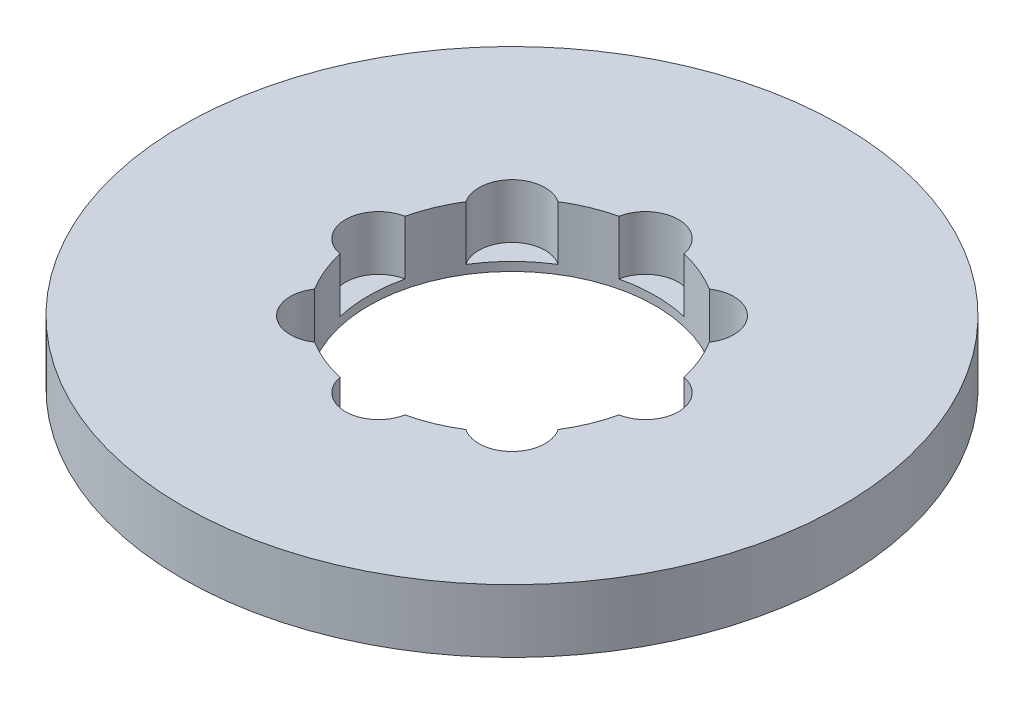
ISO-10303-21;
HEADER;
FILE_DESCRIPTION(('STEP AP214'),'2;1');
FILE_NAME('part.step','',(''),(''),'','','');
FILE_SCHEMA(('AUTOMOTIVE_DESIGN { 1 0 10303 214 1 1 1 1 }'));
ENDSEC;
DATA;
#1=APPLICATION_CONTEXT('core data for automotive mechanical design processes');
#2=APPLICATION_PROTOCOL_DEFINITION('international standard','automotive_design',2000,#1);
#3=PRODUCT_CONTEXT('',#1,'mechanical');
#4=PRODUCT('Part','Part','',(#3));
#5=PRODUCT_RELATED_PRODUCT_CATEGORY('part','',(#4));
#6=PRODUCT_DEFINITION_FORMATION('','',#4);
#7=PRODUCT_DEFINITION_CONTEXT('part definition',#1,'design');
#8=PRODUCT_DEFINITION('design','',#6,#7);
#9=PRODUCT_DEFINITION_SHAPE('','',#8);
#10=(LENGTH_UNIT() NAMED_UNIT(*) SI_UNIT(.MILLI.,.METRE.));
#11=(NAMED_UNIT(*) PLANE_ANGLE_UNIT() SI_UNIT($,.RADIAN.));
#12=(NAMED_UNIT(*) SI_UNIT($,.STERADIAN.) SOLID_ANGLE_UNIT());
#13=UNCERTAINTY_MEASURE_WITH_UNIT(LENGTH_MEASURE(1.E-05),#10,'distance_accuracy_value','');
#14=(GEOMETRIC_REPRESENTATION_CONTEXT(3) GLOBAL_UNCERTAINTY_ASSIGNED_CONTEXT((#13)) GLOBAL_UNIT_ASSIGNED_CONTEXT((#10,
#11,#12)) REPRESENTATION_CONTEXT('',''));
#15=CARTESIAN_POINT('',(0.,0.,0.));
#16=DIRECTION('',(0.,0.,1.));
#17=DIRECTION('',(1.,0.,0.));
#18=AXIS2_PLACEMENT_3D('',#15,#16,#17);
#19=CARTESIAN_POINT('',(0.,11.,0.));
#20=DIRECTION('',(0.,-1.,0.));
#21=DIRECTION('',(0.,0.,-1.));
#22=AXIS2_PLACEMENT_3D('',#19,#20,#21);
#23=CYLINDRICAL_SURFACE('',#22,57.5);
#24=CARTESIAN_POINT('',(0.,11.,0.));
#25=DIRECTION('',(0.,1.,0.));
#26=DIRECTION('',(0.,0.,1.));
#27=AXIS2_PLACEMENT_3D('',#24,#25,#26);
#28=CIRCLE('',#27,57.5);
#29=CARTESIAN_POINT('',(0.,11.,57.5));
#30=VERTEX_POINT('',#29);
#31=EDGE_CURVE('E183',#30,#30,#28,.T.);
#32=ORIENTED_EDGE('',*,*,#31,.F.);
#33=EDGE_LOOP('',(#32));
#34=FACE_BOUND('',#33,.T.);
#35=CARTESIAN_POINT('',(0.,0.,0.));
#36=DIRECTION('',(0.,1.,0.));
#37=DIRECTION('',(0.,0.,1.));
#38=AXIS2_PLACEMENT_3D('',#35,#36,#37);
#39=CIRCLE('',#38,57.5);
#40=CARTESIAN_POINT('',(0.,0.,57.5));
#41=VERTEX_POINT('',#40);
#42=EDGE_CURVE('E182',#41,#41,#39,.T.);
#43=ORIENTED_EDGE('',*,*,#42,.T.);
#44=EDGE_LOOP('',(#43));
#45=FACE_BOUND('',#44,.T.);
#46=ADVANCED_FACE('F39',(#34,#45),#23,.T.);
#47=CARTESIAN_POINT('',(0.,11.,0.));
#48=DIRECTION('',(0.,1.,0.));
#49=DIRECTION('',(0.,0.,1.));
#50=AXIS2_PLACEMENT_3D('',#47,#48,#49);
#51=PLANE('',#50);
#52=CARTESIAN_POINT('',(0.,11.,23.2714570066011));
#53=DIRECTION('',(0.,1.,0.));
#54=DIRECTION('',(1.,0.,0.));
#55=AXIS2_PLACEMENT_3D('',#52,#53,#54);
#56=CIRCLE('',#55,5.77688064739009);
#57=CARTESIAN_POINT('',(-5.67584231258927,11.,24.3471726087984));
#58=VERTEX_POINT('',#57);
#59=CARTESIAN_POINT('',(5.67584231258944,11.,24.3471726087983));
#60=VERTEX_POINT('',#59);
#61=EDGE_CURVE('E256',#58,#60,#56,.T.);
#62=ORIENTED_EDGE('',*,*,#61,.F.);
#63=CARTESIAN_POINT('',(0.,11.,0.));
#64=DIRECTION('',(0.,1.,0.));
#65=DIRECTION('',(0.,0.,1.));
#66=AXIS2_PLACEMENT_3D('',#63,#64,#65);
#67=CIRCLE('',#66,25.);
#68=CARTESIAN_POINT('',(-13.2026242662232,11.,21.2294774425782));
#69=VERTEX_POINT('',#68);
#70=EDGE_CURVE('E175',#69,#58,#67,.T.);
#71=ORIENTED_EDGE('',*,*,#70,.F.);
#72=CARTESIAN_POINT('',(-16.4554050574588,11.,16.4554050574589));
#73=DIRECTION('',(0.,1.,0.));
#74=DIRECTION('',(0.707106781186549,0.,0.707106781186546));
#75=AXIS2_PLACEMENT_3D('',#72,#73,#74);
#76=CIRCLE('',#75,5.77688064739009);
#77=CARTESIAN_POINT('',(-21.2294774425781,11.,13.2026242662232));
#78=VERTEX_POINT('',#77);
#79=EDGE_CURVE('E152',#78,#69,#76,.T.);
#80=ORIENTED_EDGE('',*,*,#79,.F.);
#81=CARTESIAN_POINT('',(-24.3471726087983,11.,5.67584231258935));
#82=VERTEX_POINT('',#81);
#83=EDGE_CURVE('E168',#82,#78,#67,.T.);
#84=ORIENTED_EDGE('',*,*,#83,.F.);
#85=CARTESIAN_POINT('',(-23.2714570066011,11.,0.));
#86=DIRECTION('',(0.,1.,0.));
#87=DIRECTION('',(0.,0.,1.));
#88=AXIS2_PLACEMENT_3D('',#85,#86,#87);
#89=CIRCLE('',#88,5.77688064739009);
#90=CARTESIAN_POINT('',(-24.3471726087983,11.,-5.67584231258935));
#91=VERTEX_POINT('',#90);
#92=EDGE_CURVE('E205',#91,#82,#89,.T.);
#93=ORIENTED_EDGE('',*,*,#92,.F.);
#94=CARTESIAN_POINT('',(-21.2294774425783,11.,-13.2026242662229));
#95=VERTEX_POINT('',#94);
#96=EDGE_CURVE('E181',#95,#91,#67,.T.);
#97=ORIENTED_EDGE('',*,*,#96,.F.);
#98=CARTESIAN_POINT('',(-16.4554050574591,11.,-16.4554050574587));
#99=DIRECTION('',(0.,1.,0.));
#100=DIRECTION('',(-0.707106781186539,0.,0.707106781186556));
#101=AXIS2_PLACEMENT_3D('',#98,#99,#100);
#102=CIRCLE('',#101,5.77688064739009);
#103=CARTESIAN_POINT('',(-13.2026242662235,11.,-21.229477442578));
#104=VERTEX_POINT('',#103);
#105=EDGE_CURVE('E453',#104,#95,#102,.T.);
#106=ORIENTED_EDGE('',*,*,#105,.F.);
#107=CARTESIAN_POINT('',(-5.67584231258961,11.,-24.3471726087983));
#108=VERTEX_POINT('',#107);
#109=EDGE_CURVE('E189',#108,#104,#67,.T.);
#110=ORIENTED_EDGE('',*,*,#109,.F.);
#111=CARTESIAN_POINT('',(-2.43755573598714E-13,11.,-23.2714570066011));
#112=DIRECTION('',(0.,1.,0.));
#113=DIRECTION('',(-1.,0.,0.));
#114=AXIS2_PLACEMENT_3D('',#111,#112,#113);
#115=CIRCLE('',#114,5.77688064739009);
#116=CARTESIAN_POINT('',(5.6758423125891,11.,-24.3471726087984));
#117=VERTEX_POINT('',#116);
#118=EDGE_CURVE('E462',#117,#108,#115,.T.);
#119=ORIENTED_EDGE('',*,*,#118,.F.);
#120=CARTESIAN_POINT('',(13.202624266223,11.,-21.2294774425783));
#121=VERTEX_POINT('',#120);
#122=EDGE_CURVE('E197',#121,#117,#67,.T.);
#123=ORIENTED_EDGE('',*,*,#122,.F.);
#124=CARTESIAN_POINT('',(16.4554050574587,11.,-16.455405057459));
#125=DIRECTION('',(0.,1.,0.));
#126=DIRECTION('',(-0.707106781186554,0.,-0.707106781186541));
#127=AXIS2_PLACEMENT_3D('',#124,#125,#126);
#128=CIRCLE('',#127,5.77688064739009);
#129=CARTESIAN_POINT('',(21.229477442578,11.,-13.2026242662234));
#130=VERTEX_POINT('',#129);
#131=EDGE_CURVE('E470',#130,#121,#128,.T.);
#132=ORIENTED_EDGE('',*,*,#131,.F.);
#133=CARTESIAN_POINT('',(24.3471726087983,11.,-5.67584231258935));
#134=VERTEX_POINT('',#133);
#135=EDGE_CURVE('E489',#134,#130,#67,.T.);
#136=ORIENTED_EDGE('',*,*,#135,.F.);
#137=CARTESIAN_POINT('',(23.2714570066011,11.,0.));
#138=DIRECTION('',(0.,1.,0.));
#139=DIRECTION('',(0.,0.,-1.));
#140=AXIS2_PLACEMENT_3D('',#137,#138,#139);
#141=CIRCLE('',#140,5.77688064739009);
#142=CARTESIAN_POINT('',(24.3471726087983,11.,5.67584231258935));
#143=VERTEX_POINT('',#142);
#144=EDGE_CURVE('E476',#143,#134,#141,.T.);
#145=ORIENTED_EDGE('',*,*,#144,.F.);
#146=CARTESIAN_POINT('',(21.2294774425782,11.,13.2026242662231));
#147=VERTEX_POINT('',#146);
#148=EDGE_CURVE('E491',#147,#143,#67,.T.);
#149=ORIENTED_EDGE('',*,*,#148,.F.);
#150=CARTESIAN_POINT('',(16.4554050574589,11.,16.4554050574588));
#151=DIRECTION('',(0.,1.,0.));
#152=DIRECTION('',(0.707106781186544,0.,-0.707106781186551));
#153=AXIS2_PLACEMENT_3D('',#150,#151,#152);
#154=CIRCLE('',#153,5.77688064739009);
#155=CARTESIAN_POINT('',(13.2026242662233,11.,21.2294774425781));
#156=VERTEX_POINT('',#155);
#157=EDGE_CURVE('E475',#156,#147,#154,.T.);
#158=ORIENTED_EDGE('',*,*,#157,.F.);
#159=EDGE_CURVE('E190',#60,#156,#67,.T.);
#160=ORIENTED_EDGE('',*,*,#159,.F.);
#161=EDGE_LOOP('',(#62,#71,#80,#84,#93,#97,#106,#110,#119,#123,#132,#136,#145,#149,#158,#160));
#162=FACE_BOUND('',#161,.T.);
#163=ORIENTED_EDGE('',*,*,#31,.T.);
#164=EDGE_LOOP('',(#163));
#165=FACE_BOUND('',#164,.T.);
#166=ADVANCED_FACE('F170',(#162,#165),#51,.T.);
#167=CARTESIAN_POINT('',(0.,0.,0.));
#168=DIRECTION('',(0.,1.,0.));
#169=DIRECTION('',(0.,0.,1.));
#170=AXIS2_PLACEMENT_3D('',#167,#168,#169);
#171=PLANE('',#170);
#172=CARTESIAN_POINT('',(0.,0.,0.));
#173=DIRECTION('',(0.,1.,0.));
#174=DIRECTION('',(0.,0.,1.));
#175=AXIS2_PLACEMENT_3D('',#172,#173,#174);
#176=CIRCLE('',#175,25.);
#177=CARTESIAN_POINT('',(0.,0.,25.));
#178=VERTEX_POINT('',#177);
#179=EDGE_CURVE('E191',#178,#178,#176,.T.);
#180=ORIENTED_EDGE('',*,*,#179,.T.);
#181=EDGE_LOOP('',(#180));
#182=FACE_BOUND('',#181,.T.);
#183=ORIENTED_EDGE('',*,*,#42,.F.);
#184=EDGE_LOOP('',(#183));
#185=FACE_BOUND('',#184,.T.);
#186=ADVANCED_FACE('F277',(#182,#185),#171,.F.);
#187=CARTESIAN_POINT('',(0.,11.,0.));
#188=DIRECTION('',(0.,-1.,0.));
#189=DIRECTION('',(0.,0.,-1.));
#190=AXIS2_PLACEMENT_3D('',#187,#188,#189);
#191=CYLINDRICAL_SURFACE('',#190,25.);
#192=DIRECTION('',(0.,1.,0.));
#193=VECTOR('',#192,1.);
#194=CARTESIAN_POINT('',(-5.67584231258927,6.25967291410345,24.3471726087984));
#195=LINE('',#194,#193);
#196=CARTESIAN_POINT('',(-5.67584231258927,1.51934582820691,24.3471726087984));
#197=VERTEX_POINT('',#196);
#198=EDGE_CURVE('E11',#197,#58,#195,.T.);
#199=ORIENTED_EDGE('',*,*,#198,.F.);
#200=CARTESIAN_POINT('',(0.,1.51934582820691,0.));
#201=DIRECTION('',(0.,1.,0.));
#202=DIRECTION('',(0.,0.,1.));
#203=AXIS2_PLACEMENT_3D('',#200,#201,#202);
#204=CIRCLE('',#203,25.);
#205=CARTESIAN_POINT('',(5.67584231258944,1.51934582820691,24.3471726087983));
#206=VERTEX_POINT('',#205);
#207=EDGE_CURVE('E251',#197,#206,#204,.T.);
#208=ORIENTED_EDGE('',*,*,#207,.T.);
#209=DIRECTION('',(0.,1.,0.));
#210=VECTOR('',#209,1.);
#211=CARTESIAN_POINT('',(5.67584231258944,6.25967291410345,24.3471726087983));
#212=LINE('',#211,#210);
#213=EDGE_CURVE('E46',#60,#206,#212,.F.);
#214=ORIENTED_EDGE('',*,*,#213,.F.);
#215=ORIENTED_EDGE('',*,*,#159,.T.);
#216=DIRECTION('',(0.,1.,0.));
#217=VECTOR('',#216,1.);
#218=CARTESIAN_POINT('',(13.2026242662233,6.25967291410345,21.2294774425781));
#219=LINE('',#218,#217);
#220=CARTESIAN_POINT('',(13.2026242662233,1.51934582820691,21.2294774425781));
#221=VERTEX_POINT('',#220);
#222=EDGE_CURVE('E253',#221,#156,#219,.T.);
#223=ORIENTED_EDGE('',*,*,#222,.F.);
#224=CARTESIAN_POINT('',(0.,1.51934582820691,0.));
#225=DIRECTION('',(0.,1.,0.));
#226=DIRECTION('',(0.,0.,1.));
#227=AXIS2_PLACEMENT_3D('',#224,#225,#226);
#228=CIRCLE('',#227,25.);
#229=CARTESIAN_POINT('',(21.2294774425782,1.51934582820691,13.2026242662231));
#230=VERTEX_POINT('',#229);
#231=EDGE_CURVE('E246',#221,#230,#228,.T.);
#232=ORIENTED_EDGE('',*,*,#231,.T.);
#233=DIRECTION('',(0.,1.,0.));
#234=VECTOR('',#233,1.);
#235=CARTESIAN_POINT('',(21.2294774425782,6.25967291410345,13.2026242662231));
#236=LINE('',#235,#234);
#237=EDGE_CURVE('E248',#147,#230,#236,.F.);
#238=ORIENTED_EDGE('',*,*,#237,.F.);
#239=ORIENTED_EDGE('',*,*,#148,.T.);
#240=DIRECTION('',(0.,1.,0.));
#241=VECTOR('',#240,1.);
#242=CARTESIAN_POINT('',(24.3471726087983,6.25967291410345,5.67584231258935));
#243=LINE('',#242,#241);
#244=CARTESIAN_POINT('',(24.3471726087983,1.51934582820691,5.67584231258935));
#245=VERTEX_POINT('',#244);
#246=EDGE_CURVE('E243',#245,#143,#243,.T.);
#247=ORIENTED_EDGE('',*,*,#246,.F.);
#248=CARTESIAN_POINT('',(0.,1.51934582820691,0.));
#249=DIRECTION('',(0.,1.,0.));
#250=DIRECTION('',(0.,0.,1.));
#251=AXIS2_PLACEMENT_3D('',#248,#249,#250);
#252=CIRCLE('',#251,25.);
#253=CARTESIAN_POINT('',(24.3471726087983,1.51934582820691,-5.67584231258935));
#254=VERTEX_POINT('',#253);
#255=EDGE_CURVE('E236',#245,#254,#252,.T.);
#256=ORIENTED_EDGE('',*,*,#255,.T.);
#257=DIRECTION('',(0.,1.,0.));
#258=VECTOR('',#257,1.);
#259=CARTESIAN_POINT('',(24.3471726087983,6.25967291410345,-5.67584231258935));
#260=LINE('',#259,#258);
#261=EDGE_CURVE('E241',#134,#254,#260,.F.);
#262=ORIENTED_EDGE('',*,*,#261,.F.);
#263=ORIENTED_EDGE('',*,*,#135,.T.);
#264=DIRECTION('',(0.,1.,0.));
#265=VECTOR('',#264,1.);
#266=CARTESIAN_POINT('',(21.229477442578,6.25967291410345,-13.2026242662234));
#267=LINE('',#266,#265);
#268=CARTESIAN_POINT('',(21.229477442578,1.51934582820691,-13.2026242662234));
#269=VERTEX_POINT('',#268);
#270=EDGE_CURVE('E237',#269,#130,#267,.T.);
#271=ORIENTED_EDGE('',*,*,#270,.F.);
#272=CARTESIAN_POINT('',(0.,1.51934582820691,0.));
#273=DIRECTION('',(0.,1.,0.));
#274=DIRECTION('',(0.,0.,1.));
#275=AXIS2_PLACEMENT_3D('',#272,#273,#274);
#276=CIRCLE('',#275,25.);
#277=CARTESIAN_POINT('',(13.202624266223,1.51934582820691,-21.2294774425783));
#278=VERTEX_POINT('',#277);
#279=EDGE_CURVE('E229',#269,#278,#276,.T.);
#280=ORIENTED_EDGE('',*,*,#279,.T.);
#281=DIRECTION('',(0.,1.,0.));
#282=VECTOR('',#281,1.);
#283=CARTESIAN_POINT('',(13.202624266223,6.25967291410345,-21.2294774425783));
#284=LINE('',#283,#282);
#285=EDGE_CURVE('E232',#121,#278,#284,.F.);
#286=ORIENTED_EDGE('',*,*,#285,.F.);
#287=ORIENTED_EDGE('',*,*,#122,.T.);
#288=DIRECTION('',(0.,1.,0.));
#289=VECTOR('',#288,1.);
#290=CARTESIAN_POINT('',(5.6758423125891,6.25967291410345,-24.3471726087984));
#291=LINE('',#290,#289);
#292=CARTESIAN_POINT('',(5.6758423125891,1.51934582820691,-24.3471726087984));
#293=VERTEX_POINT('',#292);
#294=EDGE_CURVE('E227',#293,#117,#291,.T.);
#295=ORIENTED_EDGE('',*,*,#294,.F.);
#296=CARTESIAN_POINT('',(0.,1.51934582820691,0.));
#297=DIRECTION('',(0.,1.,0.));
#298=DIRECTION('',(0.,0.,1.));
#299=AXIS2_PLACEMENT_3D('',#296,#297,#298);
#300=CIRCLE('',#299,25.);
#301=CARTESIAN_POINT('',(-5.67584231258961,1.51934582820691,-24.3471726087983));
#302=VERTEX_POINT('',#301);
#303=EDGE_CURVE('E225',#293,#302,#300,.T.);
#304=ORIENTED_EDGE('',*,*,#303,.T.);
#305=DIRECTION('',(0.,1.,0.));
#306=VECTOR('',#305,1.);
#307=CARTESIAN_POINT('',(-5.67584231258961,6.25967291410345,-24.3471726087983));
#308=LINE('',#307,#306);
#309=EDGE_CURVE('E223',#108,#302,#308,.F.);
#310=ORIENTED_EDGE('',*,*,#309,.F.);
#311=ORIENTED_EDGE('',*,*,#109,.T.);
#312=DIRECTION('',(0.,1.,0.));
#313=VECTOR('',#312,1.);
#314=CARTESIAN_POINT('',(-13.2026242662235,6.25967291410345,-21.229477442578));
#315=LINE('',#314,#313);
#316=CARTESIAN_POINT('',(-13.2026242662235,1.51934582820691,-21.229477442578));
#317=VERTEX_POINT('',#316);
#318=EDGE_CURVE('E219',#317,#104,#315,.T.);
#319=ORIENTED_EDGE('',*,*,#318,.F.);
#320=CARTESIAN_POINT('',(0.,1.51934582820691,0.));
#321=DIRECTION('',(0.,1.,0.));
#322=DIRECTION('',(0.,0.,1.));
#323=AXIS2_PLACEMENT_3D('',#320,#321,#322);
#324=CIRCLE('',#323,25.);
#325=CARTESIAN_POINT('',(-21.2294774425783,1.51934582820691,-13.2026242662229));
#326=VERTEX_POINT('',#325);
#327=EDGE_CURVE('E159',#317,#326,#324,.T.);
#328=ORIENTED_EDGE('',*,*,#327,.T.);
#329=DIRECTION('',(0.,1.,0.));
#330=VECTOR('',#329,1.);
#331=CARTESIAN_POINT('',(-21.2294774425783,6.25967291410345,-13.2026242662229));
#332=LINE('',#331,#330);
#333=EDGE_CURVE('E220',#95,#326,#332,.F.);
#334=ORIENTED_EDGE('',*,*,#333,.F.);
#335=ORIENTED_EDGE('',*,*,#96,.T.);
#336=DIRECTION('',(0.,1.,0.));
#337=VECTOR('',#336,1.);
#338=CARTESIAN_POINT('',(-24.3471726087983,6.25967291410345,-5.67584231258935));
#339=LINE('',#338,#337);
#340=CARTESIAN_POINT('',(-24.3471726087983,1.51934582820691,-5.67584231258935));
#341=VERTEX_POINT('',#340);
#342=EDGE_CURVE('E209',#341,#91,#339,.T.);
#343=ORIENTED_EDGE('',*,*,#342,.F.);
#344=CARTESIAN_POINT('',(0.,1.51934582820691,0.));
#345=DIRECTION('',(0.,1.,0.));
#346=DIRECTION('',(0.,0.,1.));
#347=AXIS2_PLACEMENT_3D('',#344,#345,#346);
#348=CIRCLE('',#347,25.);
#349=CARTESIAN_POINT('',(-24.3471726087983,1.51934582820691,5.67584231258935));
#350=VERTEX_POINT('',#349);
#351=EDGE_CURVE('E206',#341,#350,#348,.T.);
#352=ORIENTED_EDGE('',*,*,#351,.T.);
#353=DIRECTION('',(0.,1.,0.));
#354=VECTOR('',#353,1.);
#355=CARTESIAN_POINT('',(-24.3471726087983,6.25967291410345,5.67584231258935));
#356=LINE('',#355,#354);
#357=EDGE_CURVE('E179',#82,#350,#356,.F.);
#358=ORIENTED_EDGE('',*,*,#357,.F.);
#359=ORIENTED_EDGE('',*,*,#83,.T.);
#360=DIRECTION('',(0.,1.,0.));
#361=VECTOR('',#360,1.);
#362=CARTESIAN_POINT('',(-21.2294774425781,6.25967291410345,13.2026242662232));
#363=LINE('',#362,#361);
#364=CARTESIAN_POINT('',(-21.2294774425781,1.51934582820691,13.2026242662232));
#365=VERTEX_POINT('',#364);
#366=EDGE_CURVE('E147',#365,#78,#363,.T.);
#367=ORIENTED_EDGE('',*,*,#366,.F.);
#368=CARTESIAN_POINT('',(0.,1.51934582820691,0.));
#369=DIRECTION('',(0.,1.,0.));
#370=DIRECTION('',(0.,0.,1.));
#371=AXIS2_PLACEMENT_3D('',#368,#369,#370);
#372=CIRCLE('',#371,25.);
#373=CARTESIAN_POINT('',(-13.2026242662232,1.51934582820691,21.2294774425782));
#374=VERTEX_POINT('',#373);
#375=EDGE_CURVE('E215',#365,#374,#372,.T.);
#376=ORIENTED_EDGE('',*,*,#375,.T.);
#377=DIRECTION('',(0.,1.,0.));
#378=VECTOR('',#377,1.);
#379=CARTESIAN_POINT('',(-13.2026242662232,6.25967291410345,21.2294774425782));
#380=LINE('',#379,#378);
#381=EDGE_CURVE('E161',#69,#374,#380,.F.);
#382=ORIENTED_EDGE('',*,*,#381,.F.);
#383=ORIENTED_EDGE('',*,*,#70,.T.);
#384=EDGE_LOOP('',(#199,#208,#214,#215,#223,#232,#238,#239,#247,#256,#262,#263,#271,#280,#286,
#287,#295,#304,#310,#311,#319,#328,#334,#335,#343,#352,#358,#359,#367,#376,#382,#383));
#385=FACE_BOUND('',#384,.T.);
#386=ORIENTED_EDGE('',*,*,#179,.F.);
#387=EDGE_LOOP('',(#386));
#388=FACE_BOUND('',#387,.T.);
#389=ADVANCED_FACE('F176',(#385,#388),#191,.F.);
#390=CARTESIAN_POINT('',(-23.2714570066011,1.51934582820691,0.));
#391=DIRECTION('',(0.,1.,0.));
#392=DIRECTION('',(0.,0.,1.));
#393=AXIS2_PLACEMENT_3D('',#390,#391,#392);
#394=CYLINDRICAL_SURFACE('',#393,5.77688064739009);
#395=ORIENTED_EDGE('',*,*,#342,.T.);
#396=ORIENTED_EDGE('',*,*,#92,.T.);
#397=ORIENTED_EDGE('',*,*,#357,.T.);
#398=CARTESIAN_POINT('',(-23.2714570066011,1.51934582820691,0.));
#399=DIRECTION('',(0.,1.,0.));
#400=DIRECTION('',(0.,0.,1.));
#401=AXIS2_PLACEMENT_3D('',#398,#399,#400);
#402=CIRCLE('',#401,5.77688064739009);
#403=EDGE_CURVE('E200',#341,#350,#402,.T.);
#404=ORIENTED_EDGE('',*,*,#403,.F.);
#405=EDGE_LOOP('',(#395,#396,#397,#404));
#406=FACE_BOUND('',#405,.T.);
#407=ADVANCED_FACE('F286',(#406),#394,.F.);
#408=CARTESIAN_POINT('',(-23.2714570066011,1.51934582820691,0.));
#409=DIRECTION('',(0.,1.,0.));
#410=DIRECTION('',(0.,0.,1.));
#411=AXIS2_PLACEMENT_3D('',#408,#409,#410);
#412=PLANE('',#411);
#413=ORIENTED_EDGE('',*,*,#403,.T.);
#414=ORIENTED_EDGE('',*,*,#351,.F.);
#415=EDGE_LOOP('',(#413,#414));
#416=FACE_BOUND('',#415,.T.);
#417=ADVANCED_FACE('F289',(#416),#412,.T.);
#418=CARTESIAN_POINT('',(-16.4554050574588,1.51934582820691,16.4554050574589));
#419=DIRECTION('',(0.,1.,0.));
#420=DIRECTION('',(0.,0.,1.));
#421=AXIS2_PLACEMENT_3D('',#418,#419,#420);
#422=CYLINDRICAL_SURFACE('',#421,5.77688064739009);
#423=ORIENTED_EDGE('',*,*,#366,.T.);
#424=ORIENTED_EDGE('',*,*,#79,.T.);
#425=ORIENTED_EDGE('',*,*,#381,.T.);
#426=CARTESIAN_POINT('',(-16.4554050574588,1.51934582820691,16.4554050574589));
#427=DIRECTION('',(0.,1.,0.));
#428=DIRECTION('',(0.707106781186549,0.,0.707106781186546));
#429=AXIS2_PLACEMENT_3D('',#426,#427,#428);
#430=CIRCLE('',#429,5.77688064739009);
#431=EDGE_CURVE('E156',#365,#374,#430,.T.);
#432=ORIENTED_EDGE('',*,*,#431,.F.);
#433=EDGE_LOOP('',(#423,#424,#425,#432));
#434=FACE_BOUND('',#433,.T.);
#435=ADVANCED_FACE('F155',(#434),#422,.F.);
#436=CARTESIAN_POINT('',(-16.4554050574588,1.51934582820691,16.4554050574589));
#437=DIRECTION('',(0.,1.,0.));
#438=DIRECTION('',(0.707106781186549,0.,0.707106781186546));
#439=AXIS2_PLACEMENT_3D('',#436,#437,#438);
#440=PLANE('',#439);
#441=ORIENTED_EDGE('',*,*,#431,.T.);
#442=ORIENTED_EDGE('',*,*,#375,.F.);
#443=EDGE_LOOP('',(#441,#442));
#444=FACE_BOUND('',#443,.T.);
#445=ADVANCED_FACE('F300',(#444),#440,.T.);
#446=CARTESIAN_POINT('',(-16.4554050574591,1.51934582820691,-16.4554050574587));
#447=DIRECTION('',(0.,1.,0.));
#448=DIRECTION('',(0.,0.,1.));
#449=AXIS2_PLACEMENT_3D('',#446,#447,#448);
#450=CYLINDRICAL_SURFACE('',#449,5.77688064739009);
#451=ORIENTED_EDGE('',*,*,#318,.T.);
#452=ORIENTED_EDGE('',*,*,#105,.T.);
#453=ORIENTED_EDGE('',*,*,#333,.T.);
#454=CARTESIAN_POINT('',(-16.4554050574591,1.51934582820691,-16.4554050574587));
#455=DIRECTION('',(0.,1.,0.));
#456=DIRECTION('',(-0.707106781186539,0.,0.707106781186556));
#457=AXIS2_PLACEMENT_3D('',#454,#455,#456);
#458=CIRCLE('',#457,5.77688064739009);
#459=EDGE_CURVE('E454',#317,#326,#458,.T.);
#460=ORIENTED_EDGE('',*,*,#459,.F.);
#461=EDGE_LOOP('',(#451,#452,#453,#460));
#462=FACE_BOUND('',#461,.T.);
#463=ADVANCED_FACE('F299',(#462),#450,.F.);
#464=CARTESIAN_POINT('',(-16.4554050574591,1.51934582820691,-16.4554050574587));
#465=DIRECTION('',(0.,1.,0.));
#466=DIRECTION('',(-0.707106781186539,0.,0.707106781186556));
#467=AXIS2_PLACEMENT_3D('',#464,#465,#466);
#468=PLANE('',#467);
#469=ORIENTED_EDGE('',*,*,#459,.T.);
#470=ORIENTED_EDGE('',*,*,#327,.F.);
#471=EDGE_LOOP('',(#469,#470));
#472=FACE_BOUND('',#471,.T.);
#473=ADVANCED_FACE('F379',(#472),#468,.T.);
#474=CARTESIAN_POINT('',(-2.43755573598714E-13,1.51934582820691,-23.2714570066011));
#475=DIRECTION('',(0.,1.,0.));
#476=DIRECTION('',(0.,0.,1.));
#477=AXIS2_PLACEMENT_3D('',#474,#475,#476);
#478=CYLINDRICAL_SURFACE('',#477,5.77688064739009);
#479=ORIENTED_EDGE('',*,*,#294,.T.);
#480=ORIENTED_EDGE('',*,*,#118,.T.);
#481=ORIENTED_EDGE('',*,*,#309,.T.);
#482=CARTESIAN_POINT('',(-2.43755573598714E-13,1.51934582820691,-23.2714570066011));
#483=DIRECTION('',(0.,1.,0.));
#484=DIRECTION('',(-1.,0.,0.));
#485=AXIS2_PLACEMENT_3D('',#482,#483,#484);
#486=CIRCLE('',#485,5.77688064739009);
#487=EDGE_CURVE('E465',#293,#302,#486,.T.);
#488=ORIENTED_EDGE('',*,*,#487,.F.);
#489=EDGE_LOOP('',(#479,#480,#481,#488));
#490=FACE_BOUND('',#489,.T.);
#491=ADVANCED_FACE('F371',(#490),#478,.F.);
#492=CARTESIAN_POINT('',(-2.43755573598714E-13,1.51934582820691,-23.2714570066011));
#493=DIRECTION('',(0.,1.,0.));
#494=DIRECTION('',(-1.,0.,0.));
#495=AXIS2_PLACEMENT_3D('',#492,#493,#494);
#496=PLANE('',#495);
#497=ORIENTED_EDGE('',*,*,#487,.T.);
#498=ORIENTED_EDGE('',*,*,#303,.F.);
#499=EDGE_LOOP('',(#497,#498));
#500=FACE_BOUND('',#499,.T.);
#501=ADVANCED_FACE('F308',(#500),#496,.T.);
#502=CARTESIAN_POINT('',(16.4554050574587,1.51934582820691,-16.455405057459));
#503=DIRECTION('',(0.,1.,0.));
#504=DIRECTION('',(0.,0.,1.));
#505=AXIS2_PLACEMENT_3D('',#502,#503,#504);
#506=CYLINDRICAL_SURFACE('',#505,5.77688064739009);
#507=ORIENTED_EDGE('',*,*,#270,.T.);
#508=ORIENTED_EDGE('',*,*,#131,.T.);
#509=ORIENTED_EDGE('',*,*,#285,.T.);
#510=CARTESIAN_POINT('',(16.4554050574587,1.51934582820691,-16.455405057459));
#511=DIRECTION('',(0.,1.,0.));
#512=DIRECTION('',(-0.707106781186554,0.,-0.707106781186541));
#513=AXIS2_PLACEMENT_3D('',#510,#511,#512);
#514=CIRCLE('',#513,5.77688064739009);
#515=EDGE_CURVE('E477',#269,#278,#514,.T.);
#516=ORIENTED_EDGE('',*,*,#515,.F.);
#517=EDGE_LOOP('',(#507,#508,#509,#516));
#518=FACE_BOUND('',#517,.T.);
#519=ADVANCED_FACE('F305',(#518),#506,.F.);
#520=CARTESIAN_POINT('',(16.4554050574587,1.51934582820691,-16.455405057459));
#521=DIRECTION('',(0.,1.,0.));
#522=DIRECTION('',(-0.707106781186554,0.,-0.707106781186541));
#523=AXIS2_PLACEMENT_3D('',#520,#521,#522);
#524=PLANE('',#523);
#525=ORIENTED_EDGE('',*,*,#515,.T.);
#526=ORIENTED_EDGE('',*,*,#279,.F.);
#527=EDGE_LOOP('',(#525,#526));
#528=FACE_BOUND('',#527,.T.);
#529=ADVANCED_FACE('F304',(#528),#524,.T.);
#530=CARTESIAN_POINT('',(23.2714570066011,1.51934582820691,0.));
#531=DIRECTION('',(0.,1.,0.));
#532=DIRECTION('',(0.,0.,1.));
#533=AXIS2_PLACEMENT_3D('',#530,#531,#532);
#534=CYLINDRICAL_SURFACE('',#533,5.77688064739009);
#535=ORIENTED_EDGE('',*,*,#246,.T.);
#536=ORIENTED_EDGE('',*,*,#144,.T.);
#537=ORIENTED_EDGE('',*,*,#261,.T.);
#538=CARTESIAN_POINT('',(23.2714570066011,1.51934582820691,0.));
#539=DIRECTION('',(0.,1.,0.));
#540=DIRECTION('',(0.,0.,-1.));
#541=AXIS2_PLACEMENT_3D('',#538,#539,#540);
#542=CIRCLE('',#541,5.77688064739009);
#543=EDGE_CURVE('E478',#245,#254,#542,.T.);
#544=ORIENTED_EDGE('',*,*,#543,.F.);
#545=EDGE_LOOP('',(#535,#536,#537,#544));
#546=FACE_BOUND('',#545,.T.);
#547=ADVANCED_FACE('F309',(#546),#534,.F.);
#548=CARTESIAN_POINT('',(23.2714570066011,1.51934582820691,0.));
#549=DIRECTION('',(0.,1.,0.));
#550=DIRECTION('',(0.,0.,-1.));
#551=AXIS2_PLACEMENT_3D('',#548,#549,#550);
#552=PLANE('',#551);
#553=ORIENTED_EDGE('',*,*,#543,.T.);
#554=ORIENTED_EDGE('',*,*,#255,.F.);
#555=EDGE_LOOP('',(#553,#554));
#556=FACE_BOUND('',#555,.T.);
#557=ADVANCED_FACE('F314',(#556),#552,.T.);
#558=CARTESIAN_POINT('',(16.4554050574589,1.51934582820691,16.4554050574588));
#559=DIRECTION('',(0.,1.,0.));
#560=DIRECTION('',(0.,0.,1.));
#561=AXIS2_PLACEMENT_3D('',#558,#559,#560);
#562=CYLINDRICAL_SURFACE('',#561,5.77688064739009);
#563=ORIENTED_EDGE('',*,*,#222,.T.);
#564=ORIENTED_EDGE('',*,*,#157,.T.);
#565=ORIENTED_EDGE('',*,*,#237,.T.);
#566=CARTESIAN_POINT('',(16.4554050574589,1.51934582820691,16.4554050574588));
#567=DIRECTION('',(0.,1.,0.));
#568=DIRECTION('',(0.707106781186544,0.,-0.707106781186551));
#569=AXIS2_PLACEMENT_3D('',#566,#567,#568);
#570=CIRCLE('',#569,5.77688064739009);
#571=EDGE_CURVE('E56',#221,#230,#570,.T.);
#572=ORIENTED_EDGE('',*,*,#571,.F.);
#573=EDGE_LOOP('',(#563,#564,#565,#572));
#574=FACE_BOUND('',#573,.T.);
#575=ADVANCED_FACE('F318',(#574),#562,.F.);
#576=CARTESIAN_POINT('',(16.4554050574589,1.51934582820691,16.4554050574588));
#577=DIRECTION('',(0.,1.,0.));
#578=DIRECTION('',(0.707106781186544,0.,-0.707106781186551));
#579=AXIS2_PLACEMENT_3D('',#576,#577,#578);
#580=PLANE('',#579);
#581=ORIENTED_EDGE('',*,*,#571,.T.);
#582=ORIENTED_EDGE('',*,*,#231,.F.);
#583=EDGE_LOOP('',(#581,#582));
#584=FACE_BOUND('',#583,.T.);
#585=ADVANCED_FACE('F270',(#584),#580,.T.);
#586=CARTESIAN_POINT('',(0.,1.51934582820691,23.2714570066011));
#587=DIRECTION('',(0.,1.,0.));
#588=DIRECTION('',(0.,0.,1.));
#589=AXIS2_PLACEMENT_3D('',#586,#587,#588);
#590=CYLINDRICAL_SURFACE('',#589,5.77688064739009);
#591=ORIENTED_EDGE('',*,*,#198,.T.);
#592=ORIENTED_EDGE('',*,*,#61,.T.);
#593=ORIENTED_EDGE('',*,*,#213,.T.);
#594=CARTESIAN_POINT('',(0.,1.51934582820691,23.2714570066011));
#595=DIRECTION('',(0.,1.,0.));
#596=DIRECTION('',(1.,0.,0.));
#597=AXIS2_PLACEMENT_3D('',#594,#595,#596);
#598=CIRCLE('',#597,5.77688064739009);
#599=EDGE_CURVE('E55',#197,#206,#598,.T.);
#600=ORIENTED_EDGE('',*,*,#599,.F.);
#601=EDGE_LOOP('',(#591,#592,#593,#600));
#602=FACE_BOUND('',#601,.T.);
#603=ADVANCED_FACE('F260',(#602),#590,.F.);
#604=CARTESIAN_POINT('',(0.,1.51934582820691,23.2714570066011));
#605=DIRECTION('',(0.,1.,0.));
#606=DIRECTION('',(1.,0.,0.));
#607=AXIS2_PLACEMENT_3D('',#604,#605,#606);
#608=PLANE('',#607);
#609=ORIENTED_EDGE('',*,*,#599,.T.);
#610=ORIENTED_EDGE('',*,*,#207,.F.);
#611=EDGE_LOOP('',(#609,#610));
#612=FACE_BOUND('',#611,.T.);
#613=ADVANCED_FACE('F261',(#612),#608,.T.);
#614=CLOSED_SHELL('',(#46,#166,#186,#389,#407,#417,#435,#445,#463,#473,#491,#501,#519,#529,#547,
#557,#575,#585,#603,#613));
#615=MANIFOLD_SOLID_BREP('B2',#614);
#616=ADVANCED_BREP_SHAPE_REPRESENTATION('',(#18,#615),#14);
#617=SHAPE_DEFINITION_REPRESENTATION(#9,#616);
ENDSEC;
END-ISO-10303-21;
